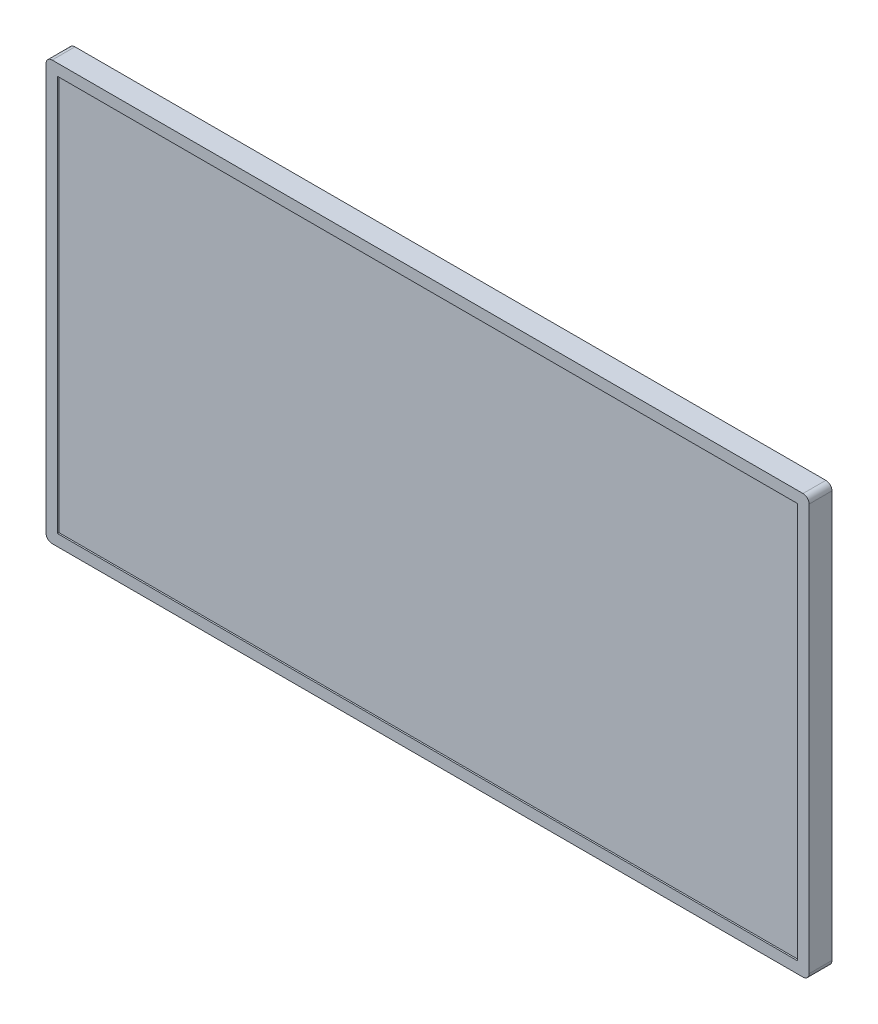
ISO-10303-21;
HEADER;
FILE_DESCRIPTION(('STEP AP214'),'2;1');
FILE_NAME('part.step','',(''),(''),'','','');
FILE_SCHEMA(('AUTOMOTIVE_DESIGN { 1 0 10303 214 1 1 1 1 }'));
ENDSEC;
DATA;
#1=APPLICATION_CONTEXT('core data for automotive mechanical design processes');
#2=APPLICATION_PROTOCOL_DEFINITION('international standard','automotive_design',2000,#1);
#3=PRODUCT_CONTEXT('',#1,'mechanical');
#4=PRODUCT('Part','Part','',(#3));
#5=PRODUCT_RELATED_PRODUCT_CATEGORY('part','',(#4));
#6=PRODUCT_DEFINITION_FORMATION('','',#4);
#7=PRODUCT_DEFINITION_CONTEXT('part definition',#1,'design');
#8=PRODUCT_DEFINITION('design','',#6,#7);
#9=PRODUCT_DEFINITION_SHAPE('','',#8);
#10=(LENGTH_UNIT() NAMED_UNIT(*) SI_UNIT(.MILLI.,.METRE.));
#11=(NAMED_UNIT(*) PLANE_ANGLE_UNIT() SI_UNIT($,.RADIAN.));
#12=(NAMED_UNIT(*) SI_UNIT($,.STERADIAN.) SOLID_ANGLE_UNIT());
#13=UNCERTAINTY_MEASURE_WITH_UNIT(LENGTH_MEASURE(1.E-05),#10,'distance_accuracy_value','');
#14=(GEOMETRIC_REPRESENTATION_CONTEXT(3) GLOBAL_UNCERTAINTY_ASSIGNED_CONTEXT((#13)) GLOBAL_UNIT_ASSIGNED_CONTEXT((#10,
#11,#12)) REPRESENTATION_CONTEXT('',''));
#15=CARTESIAN_POINT('',(0.,0.,0.));
#16=DIRECTION('',(0.,0.,1.));
#17=DIRECTION('',(1.,0.,0.));
#18=AXIS2_PLACEMENT_3D('',#15,#16,#17);
#19=CARTESIAN_POINT('',(0.,0.,30.));
#20=DIRECTION('',(1.,0.,0.));
#21=DIRECTION('',(0.,1.,0.));
#22=AXIS2_PLACEMENT_3D('',#19,#20,#21);
#23=PLANE('',#22);
#24=DIRECTION('',(0.,-1.,0.));
#25=VECTOR('',#24,1.);
#26=CARTESIAN_POINT('',(0.,0.,0.));
#27=LINE('',#26,#25);
#28=CARTESIAN_POINT('',(0.,542.,0.));
#29=VERTEX_POINT('',#28);
#30=CARTESIAN_POINT('',(0.,8.,0.));
#31=VERTEX_POINT('',#30);
#32=EDGE_CURVE('E163',#29,#31,#27,.T.);
#33=ORIENTED_EDGE('',*,*,#32,.T.);
#34=DIRECTION('',(0.,0.,-1.));
#35=VECTOR('',#34,1.);
#36=CARTESIAN_POINT('',(0.,8.,30.));
#37=LINE('',#36,#35);
#38=CARTESIAN_POINT('',(0.,8.,30.));
#39=VERTEX_POINT('',#38);
#40=EDGE_CURVE('E203',#31,#39,#37,.F.);
#41=ORIENTED_EDGE('',*,*,#40,.T.);
#42=DIRECTION('',(0.,-1.,0.));
#43=VECTOR('',#42,1.);
#44=CARTESIAN_POINT('',(0.,0.,30.));
#45=LINE('',#44,#43);
#46=CARTESIAN_POINT('',(0.,542.,30.));
#47=VERTEX_POINT('',#46);
#48=EDGE_CURVE('E167',#47,#39,#45,.T.);
#49=ORIENTED_EDGE('',*,*,#48,.F.);
#50=DIRECTION('',(0.,0.,-1.));
#51=VECTOR('',#50,1.);
#52=CARTESIAN_POINT('',(0.,542.,30.));
#53=LINE('',#52,#51);
#54=EDGE_CURVE('E200',#47,#29,#53,.T.);
#55=ORIENTED_EDGE('',*,*,#54,.T.);
#56=EDGE_LOOP('',(#33,#41,#49,#55));
#57=FACE_BOUND('',#56,.T.);
#58=ADVANCED_FACE('F34',(#57),#23,.F.);
#59=CARTESIAN_POINT('',(0.,0.,30.));
#60=DIRECTION('',(0.,1.,0.));
#61=DIRECTION('',(-1.,0.,0.));
#62=AXIS2_PLACEMENT_3D('',#59,#60,#61);
#63=PLANE('',#62);
#64=DIRECTION('',(1.,0.,0.));
#65=VECTOR('',#64,1.);
#66=CARTESIAN_POINT('',(0.,0.,30.));
#67=LINE('',#66,#65);
#68=CARTESIAN_POINT('',(8.,0.,30.));
#69=VERTEX_POINT('',#68);
#70=CARTESIAN_POINT('',(993.972554514344,0.,30.));
#71=VERTEX_POINT('',#70);
#72=EDGE_CURVE('E170',#69,#71,#67,.T.);
#73=ORIENTED_EDGE('',*,*,#72,.F.);
#74=DIRECTION('',(0.,0.,-1.));
#75=VECTOR('',#74,1.);
#76=CARTESIAN_POINT('',(8.,0.,30.));
#77=LINE('',#76,#75);
#78=CARTESIAN_POINT('',(8.,0.,0.));
#79=VERTEX_POINT('',#78);
#80=EDGE_CURVE('E189',#69,#79,#77,.T.);
#81=ORIENTED_EDGE('',*,*,#80,.T.);
#82=DIRECTION('',(1.,0.,0.));
#83=VECTOR('',#82,1.);
#84=CARTESIAN_POINT('',(0.,0.,0.));
#85=LINE('',#84,#83);
#86=CARTESIAN_POINT('',(993.972554514344,0.,0.));
#87=VERTEX_POINT('',#86);
#88=EDGE_CURVE('E181',#79,#87,#85,.T.);
#89=ORIENTED_EDGE('',*,*,#88,.T.);
#90=DIRECTION('',(0.,0.,-1.));
#91=VECTOR('',#90,1.);
#92=CARTESIAN_POINT('',(993.972554514344,0.,30.));
#93=LINE('',#92,#91);
#94=EDGE_CURVE('E178',#87,#71,#93,.F.);
#95=ORIENTED_EDGE('',*,*,#94,.T.);
#96=EDGE_LOOP('',(#73,#81,#89,#95));
#97=FACE_BOUND('',#96,.T.);
#98=ADVANCED_FACE('F246',(#97),#63,.F.);
#99=CARTESIAN_POINT('',(1001.97255451434,0.,30.));
#100=DIRECTION('',(-1.,0.,0.));
#101=DIRECTION('',(0.,0.,1.));
#102=AXIS2_PLACEMENT_3D('',#99,#100,#101);
#103=PLANE('',#102);
#104=DIRECTION('',(0.,1.,0.));
#105=VECTOR('',#104,1.);
#106=CARTESIAN_POINT('',(1001.97255451434,0.,30.));
#107=LINE('',#106,#105);
#108=CARTESIAN_POINT('',(1001.97255451434,8.,30.));
#109=VERTEX_POINT('',#108);
#110=CARTESIAN_POINT('',(1001.97255451434,542.,30.));
#111=VERTEX_POINT('',#110);
#112=EDGE_CURVE('E174',#109,#111,#107,.T.);
#113=ORIENTED_EDGE('',*,*,#112,.F.);
#114=DIRECTION('',(0.,0.,-1.));
#115=VECTOR('',#114,1.);
#116=CARTESIAN_POINT('',(1001.97255451434,8.,30.));
#117=LINE('',#116,#115);
#118=CARTESIAN_POINT('',(1001.97255451434,8.,0.));
#119=VERTEX_POINT('',#118);
#120=EDGE_CURVE('E214',#109,#119,#117,.T.);
#121=ORIENTED_EDGE('',*,*,#120,.T.);
#122=DIRECTION('',(0.,1.,0.));
#123=VECTOR('',#122,1.);
#124=CARTESIAN_POINT('',(1001.97255451434,0.,0.));
#125=LINE('',#124,#123);
#126=CARTESIAN_POINT('',(1001.97255451434,542.,0.));
#127=VERTEX_POINT('',#126);
#128=EDGE_CURVE('E184',#119,#127,#125,.T.);
#129=ORIENTED_EDGE('',*,*,#128,.T.);
#130=DIRECTION('',(0.,0.,-1.));
#131=VECTOR('',#130,1.);
#132=CARTESIAN_POINT('',(1001.97255451434,542.,30.));
#133=LINE('',#132,#131);
#134=EDGE_CURVE('E212',#127,#111,#133,.F.);
#135=ORIENTED_EDGE('',*,*,#134,.T.);
#136=EDGE_LOOP('',(#113,#121,#129,#135));
#137=FACE_BOUND('',#136,.T.);
#138=ADVANCED_FACE('F220',(#137),#103,.F.);
#139=CARTESIAN_POINT('',(0.,550.,30.));
#140=DIRECTION('',(0.,-1.,0.));
#141=DIRECTION('',(0.,0.,-1.));
#142=AXIS2_PLACEMENT_3D('',#139,#140,#141);
#143=PLANE('',#142);
#144=DIRECTION('',(-1.,0.,0.));
#145=VECTOR('',#144,1.);
#146=CARTESIAN_POINT('',(0.,550.,30.));
#147=LINE('',#146,#145);
#148=CARTESIAN_POINT('',(993.972554514344,550.,30.));
#149=VERTEX_POINT('',#148);
#150=CARTESIAN_POINT('',(8.00000000000004,550.,30.));
#151=VERTEX_POINT('',#150);
#152=EDGE_CURVE('E176',#149,#151,#147,.T.);
#153=ORIENTED_EDGE('',*,*,#152,.F.);
#154=DIRECTION('',(0.,0.,-1.));
#155=VECTOR('',#154,1.);
#156=CARTESIAN_POINT('',(993.972554514344,550.,30.));
#157=LINE('',#156,#155);
#158=CARTESIAN_POINT('',(993.972554514344,550.,0.));
#159=VERTEX_POINT('',#158);
#160=EDGE_CURVE('E11',#149,#159,#157,.T.);
#161=ORIENTED_EDGE('',*,*,#160,.T.);
#162=DIRECTION('',(-1.,0.,0.));
#163=VECTOR('',#162,1.);
#164=CARTESIAN_POINT('',(0.,550.,0.));
#165=LINE('',#164,#163);
#166=CARTESIAN_POINT('',(8.00000000000004,550.,0.));
#167=VERTEX_POINT('',#166);
#168=EDGE_CURVE('E171',#159,#167,#165,.T.);
#169=ORIENTED_EDGE('',*,*,#168,.T.);
#170=DIRECTION('',(0.,0.,-1.));
#171=VECTOR('',#170,1.);
#172=CARTESIAN_POINT('',(8.00000000000004,550.,30.));
#173=LINE('',#172,#171);
#174=EDGE_CURVE('E42',#167,#151,#173,.F.);
#175=ORIENTED_EDGE('',*,*,#174,.T.);
#176=EDGE_LOOP('',(#153,#161,#169,#175));
#177=FACE_BOUND('',#176,.T.);
#178=ADVANCED_FACE('F231',(#177),#143,.F.);
#179=CARTESIAN_POINT('',(0.,0.,30.));
#180=DIRECTION('',(0.,0.,-1.));
#181=DIRECTION('',(-1.,0.,0.));
#182=AXIS2_PLACEMENT_3D('',#179,#180,#181);
#183=PLANE('',#182);
#184=DIRECTION('',(1.,0.,0.));
#185=VECTOR('',#184,1.);
#186=CARTESIAN_POINT('',(986.972554514344,15.,30.));
#187=LINE('',#186,#185);
#188=CARTESIAN_POINT('',(15.0000000000001,15.,30.));
#189=VERTEX_POINT('',#188);
#190=CARTESIAN_POINT('',(986.972554514344,15.,30.));
#191=VERTEX_POINT('',#190);
#192=EDGE_CURVE('E157',#189,#191,#187,.T.);
#193=ORIENTED_EDGE('',*,*,#192,.F.);
#194=DIRECTION('',(0.,-1.,0.));
#195=VECTOR('',#194,1.);
#196=CARTESIAN_POINT('',(15.0000000000001,15.,30.));
#197=LINE('',#196,#195);
#198=CARTESIAN_POINT('',(15.0000000000001,535.,30.));
#199=VERTEX_POINT('',#198);
#200=EDGE_CURVE('E131',#199,#189,#197,.T.);
#201=ORIENTED_EDGE('',*,*,#200,.F.);
#202=DIRECTION('',(-1.,0.,0.));
#203=VECTOR('',#202,1.);
#204=CARTESIAN_POINT('',(986.972554514344,535.,30.));
#205=LINE('',#204,#203);
#206=CARTESIAN_POINT('',(986.972554514344,535.,30.));
#207=VERTEX_POINT('',#206);
#208=EDGE_CURVE('E148',#207,#199,#205,.T.);
#209=ORIENTED_EDGE('',*,*,#208,.F.);
#210=DIRECTION('',(0.,1.,0.));
#211=VECTOR('',#210,1.);
#212=CARTESIAN_POINT('',(986.972554514344,15.,30.));
#213=LINE('',#212,#211);
#214=EDGE_CURVE('E151',#191,#207,#213,.T.);
#215=ORIENTED_EDGE('',*,*,#214,.F.);
#216=EDGE_LOOP('',(#193,#201,#209,#215));
#217=FACE_BOUND('',#216,.T.);
#218=ORIENTED_EDGE('',*,*,#48,.T.);
#219=CARTESIAN_POINT('',(8.,8.,30.));
#220=DIRECTION('',(0.,0.,-1.));
#221=DIRECTION('',(-1.,0.,0.));
#222=AXIS2_PLACEMENT_3D('',#219,#220,#221);
#223=CIRCLE('',#222,8.);
#224=EDGE_CURVE('E210',#39,#69,#223,.F.);
#225=ORIENTED_EDGE('',*,*,#224,.T.);
#226=ORIENTED_EDGE('',*,*,#72,.T.);
#227=CARTESIAN_POINT('',(993.972554514344,8.,30.));
#228=DIRECTION('',(0.,0.,-1.));
#229=DIRECTION('',(-1.,0.,0.));
#230=AXIS2_PLACEMENT_3D('',#227,#228,#229);
#231=CIRCLE('',#230,8.);
#232=EDGE_CURVE('E208',#71,#109,#231,.F.);
#233=ORIENTED_EDGE('',*,*,#232,.T.);
#234=ORIENTED_EDGE('',*,*,#112,.T.);
#235=CARTESIAN_POINT('',(993.972554514344,542.,30.));
#236=DIRECTION('',(0.,0.,-1.));
#237=DIRECTION('',(-1.,0.,0.));
#238=AXIS2_PLACEMENT_3D('',#235,#236,#237);
#239=CIRCLE('',#238,8.);
#240=EDGE_CURVE('E55',#111,#149,#239,.F.);
#241=ORIENTED_EDGE('',*,*,#240,.T.);
#242=ORIENTED_EDGE('',*,*,#152,.T.);
#243=CARTESIAN_POINT('',(8.00000000000004,542.,30.));
#244=DIRECTION('',(0.,0.,-1.));
#245=DIRECTION('',(-1.,0.,0.));
#246=AXIS2_PLACEMENT_3D('',#243,#244,#245);
#247=CIRCLE('',#246,8.);
#248=EDGE_CURVE('E205',#151,#47,#247,.F.);
#249=ORIENTED_EDGE('',*,*,#248,.T.);
#250=EDGE_LOOP('',(#218,#225,#226,#233,#234,#241,#242,#249));
#251=FACE_BOUND('',#250,.T.);
#252=ADVANCED_FACE('F233',(#217,#251),#183,.F.);
#253=CARTESIAN_POINT('',(0.,0.,0.));
#254=DIRECTION('',(0.,0.,-1.));
#255=DIRECTION('',(-1.,0.,0.));
#256=AXIS2_PLACEMENT_3D('',#253,#254,#255);
#257=PLANE('',#256);
#258=ORIENTED_EDGE('',*,*,#88,.F.);
#259=CARTESIAN_POINT('',(8.,8.,0.));
#260=DIRECTION('',(0.,0.,-1.));
#261=DIRECTION('',(-1.,0.,0.));
#262=AXIS2_PLACEMENT_3D('',#259,#260,#261);
#263=CIRCLE('',#262,8.);
#264=EDGE_CURVE('E198',#79,#31,#263,.T.);
#265=ORIENTED_EDGE('',*,*,#264,.T.);
#266=ORIENTED_EDGE('',*,*,#32,.F.);
#267=CARTESIAN_POINT('',(8.00000000000004,542.,0.));
#268=DIRECTION('',(0.,0.,-1.));
#269=DIRECTION('',(-1.,0.,0.));
#270=AXIS2_PLACEMENT_3D('',#267,#268,#269);
#271=CIRCLE('',#270,8.);
#272=EDGE_CURVE('E192',#29,#167,#271,.T.);
#273=ORIENTED_EDGE('',*,*,#272,.T.);
#274=ORIENTED_EDGE('',*,*,#168,.F.);
#275=CARTESIAN_POINT('',(993.972554514344,542.,0.));
#276=DIRECTION('',(0.,0.,-1.));
#277=DIRECTION('',(-1.,0.,0.));
#278=AXIS2_PLACEMENT_3D('',#275,#276,#277);
#279=CIRCLE('',#278,8.);
#280=EDGE_CURVE('E194',#159,#127,#279,.T.);
#281=ORIENTED_EDGE('',*,*,#280,.T.);
#282=ORIENTED_EDGE('',*,*,#128,.F.);
#283=CARTESIAN_POINT('',(993.972554514344,8.,0.));
#284=DIRECTION('',(0.,0.,-1.));
#285=DIRECTION('',(-1.,0.,0.));
#286=AXIS2_PLACEMENT_3D('',#283,#284,#285);
#287=CIRCLE('',#286,8.);
#288=EDGE_CURVE('E196',#119,#87,#287,.T.);
#289=ORIENTED_EDGE('',*,*,#288,.T.);
#290=EDGE_LOOP('',(#258,#265,#266,#273,#274,#281,#282,#289));
#291=FACE_BOUND('',#290,.T.);
#292=ADVANCED_FACE('F226',(#291),#257,.T.);
#293=CARTESIAN_POINT('',(15.0000000000001,15.,28.));
#294=DIRECTION('',(-1.,0.,0.));
#295=DIRECTION('',(0.,0.,1.));
#296=AXIS2_PLACEMENT_3D('',#293,#294,#295);
#297=PLANE('',#296);
#298=ORIENTED_EDGE('',*,*,#200,.T.);
#299=DIRECTION('',(0.,0.,1.));
#300=VECTOR('',#299,1.);
#301=CARTESIAN_POINT('',(15.0000000000001,15.,28.));
#302=LINE('',#301,#300);
#303=CARTESIAN_POINT('',(15.0000000000001,15.,28.));
#304=VERTEX_POINT('',#303);
#305=EDGE_CURVE('E124',#304,#189,#302,.T.);
#306=ORIENTED_EDGE('',*,*,#305,.F.);
#307=DIRECTION('',(0.,-1.,0.));
#308=VECTOR('',#307,1.);
#309=CARTESIAN_POINT('',(15.0000000000001,15.,28.));
#310=LINE('',#309,#308);
#311=CARTESIAN_POINT('',(15.0000000000001,535.,28.));
#312=VERTEX_POINT('',#311);
#313=EDGE_CURVE('E128',#312,#304,#310,.T.);
#314=ORIENTED_EDGE('',*,*,#313,.F.);
#315=DIRECTION('',(0.,0.,1.));
#316=VECTOR('',#315,1.);
#317=CARTESIAN_POINT('',(15.0000000000001,535.,28.));
#318=LINE('',#317,#316);
#319=EDGE_CURVE('E161',#312,#199,#318,.T.);
#320=ORIENTED_EDGE('',*,*,#319,.T.);
#321=EDGE_LOOP('',(#298,#306,#314,#320));
#322=FACE_BOUND('',#321,.T.);
#323=ADVANCED_FACE('F126',(#322),#297,.F.);
#324=CARTESIAN_POINT('',(986.972554514344,535.,28.));
#325=DIRECTION('',(0.,1.,0.));
#326=DIRECTION('',(0.,0.,1.));
#327=AXIS2_PLACEMENT_3D('',#324,#325,#326);
#328=PLANE('',#327);
#329=ORIENTED_EDGE('',*,*,#208,.T.);
#330=ORIENTED_EDGE('',*,*,#319,.F.);
#331=DIRECTION('',(-1.,0.,0.));
#332=VECTOR('',#331,1.);
#333=CARTESIAN_POINT('',(986.972554514344,535.,28.));
#334=LINE('',#333,#332);
#335=CARTESIAN_POINT('',(986.972554514344,535.,28.));
#336=VERTEX_POINT('',#335);
#337=EDGE_CURVE('E136',#336,#312,#334,.T.);
#338=ORIENTED_EDGE('',*,*,#337,.F.);
#339=DIRECTION('',(0.,0.,1.));
#340=VECTOR('',#339,1.);
#341=CARTESIAN_POINT('',(986.972554514344,535.,28.));
#342=LINE('',#341,#340);
#343=EDGE_CURVE('E164',#336,#207,#342,.T.);
#344=ORIENTED_EDGE('',*,*,#343,.T.);
#345=EDGE_LOOP('',(#329,#330,#338,#344));
#346=FACE_BOUND('',#345,.T.);
#347=ADVANCED_FACE('F274',(#346),#328,.F.);
#348=CARTESIAN_POINT('',(986.972554514344,15.,28.));
#349=DIRECTION('',(1.,0.,0.));
#350=DIRECTION('',(0.,0.,-1.));
#351=AXIS2_PLACEMENT_3D('',#348,#349,#350);
#352=PLANE('',#351);
#353=ORIENTED_EDGE('',*,*,#214,.T.);
#354=ORIENTED_EDGE('',*,*,#343,.F.);
#355=DIRECTION('',(0.,1.,0.));
#356=VECTOR('',#355,1.);
#357=CARTESIAN_POINT('',(986.972554514344,15.,28.));
#358=LINE('',#357,#356);
#359=CARTESIAN_POINT('',(986.972554514344,15.,28.));
#360=VERTEX_POINT('',#359);
#361=EDGE_CURVE('E144',#360,#336,#358,.T.);
#362=ORIENTED_EDGE('',*,*,#361,.F.);
#363=DIRECTION('',(0.,0.,1.));
#364=VECTOR('',#363,1.);
#365=CARTESIAN_POINT('',(986.972554514344,15.,28.));
#366=LINE('',#365,#364);
#367=EDGE_CURVE('E135',#360,#191,#366,.T.);
#368=ORIENTED_EDGE('',*,*,#367,.T.);
#369=EDGE_LOOP('',(#353,#354,#362,#368));
#370=FACE_BOUND('',#369,.T.);
#371=ADVANCED_FACE('F277',(#370),#352,.F.);
#372=CARTESIAN_POINT('',(986.972554514344,15.,28.));
#373=DIRECTION('',(0.,-1.,0.));
#374=DIRECTION('',(0.,0.,-1.));
#375=AXIS2_PLACEMENT_3D('',#372,#373,#374);
#376=PLANE('',#375);
#377=ORIENTED_EDGE('',*,*,#192,.T.);
#378=ORIENTED_EDGE('',*,*,#367,.F.);
#379=DIRECTION('',(1.,0.,0.));
#380=VECTOR('',#379,1.);
#381=CARTESIAN_POINT('',(986.972554514344,15.,28.));
#382=LINE('',#381,#380);
#383=EDGE_CURVE('E139',#304,#360,#382,.T.);
#384=ORIENTED_EDGE('',*,*,#383,.F.);
#385=ORIENTED_EDGE('',*,*,#305,.T.);
#386=EDGE_LOOP('',(#377,#378,#384,#385));
#387=FACE_BOUND('',#386,.T.);
#388=ADVANCED_FACE('F140',(#387),#376,.F.);
#389=CARTESIAN_POINT('',(0.,0.,28.));
#390=DIRECTION('',(0.,0.,1.));
#391=DIRECTION('',(1.,0.,0.));
#392=AXIS2_PLACEMENT_3D('',#389,#390,#391);
#393=PLANE('',#392);
#394=ORIENTED_EDGE('',*,*,#313,.T.);
#395=ORIENTED_EDGE('',*,*,#383,.T.);
#396=ORIENTED_EDGE('',*,*,#361,.T.);
#397=ORIENTED_EDGE('',*,*,#337,.T.);
#398=EDGE_LOOP('',(#394,#395,#396,#397));
#399=FACE_BOUND('',#398,.T.);
#400=ADVANCED_FACE('F146',(#399),#393,.T.);
#401=CARTESIAN_POINT('',(8.,8.,30.));
#402=DIRECTION('',(0.,0.,-1.));
#403=DIRECTION('',(-1.,0.,0.));
#404=AXIS2_PLACEMENT_3D('',#401,#402,#403);
#405=CYLINDRICAL_SURFACE('',#404,8.);
#406=ORIENTED_EDGE('',*,*,#224,.F.);
#407=ORIENTED_EDGE('',*,*,#40,.F.);
#408=ORIENTED_EDGE('',*,*,#264,.F.);
#409=ORIENTED_EDGE('',*,*,#80,.F.);
#410=EDGE_LOOP('',(#406,#407,#408,#409));
#411=FACE_BOUND('',#410,.T.);
#412=ADVANCED_FACE('F243',(#411),#405,.T.);
#413=CARTESIAN_POINT('',(993.972554514344,8.,30.));
#414=DIRECTION('',(0.,0.,-1.));
#415=DIRECTION('',(-1.,0.,0.));
#416=AXIS2_PLACEMENT_3D('',#413,#414,#415);
#417=CYLINDRICAL_SURFACE('',#416,8.);
#418=ORIENTED_EDGE('',*,*,#232,.F.);
#419=ORIENTED_EDGE('',*,*,#94,.F.);
#420=ORIENTED_EDGE('',*,*,#288,.F.);
#421=ORIENTED_EDGE('',*,*,#120,.F.);
#422=EDGE_LOOP('',(#418,#419,#420,#421));
#423=FACE_BOUND('',#422,.T.);
#424=ADVANCED_FACE('F248',(#423),#417,.T.);
#425=CARTESIAN_POINT('',(993.972554514344,542.,30.));
#426=DIRECTION('',(0.,0.,-1.));
#427=DIRECTION('',(-1.,0.,0.));
#428=AXIS2_PLACEMENT_3D('',#425,#426,#427);
#429=CYLINDRICAL_SURFACE('',#428,8.);
#430=ORIENTED_EDGE('',*,*,#240,.F.);
#431=ORIENTED_EDGE('',*,*,#134,.F.);
#432=ORIENTED_EDGE('',*,*,#280,.F.);
#433=ORIENTED_EDGE('',*,*,#160,.F.);
#434=EDGE_LOOP('',(#430,#431,#432,#433));
#435=FACE_BOUND('',#434,.T.);
#436=ADVANCED_FACE('F230',(#435),#429,.T.);
#437=CARTESIAN_POINT('',(8.00000000000004,542.,30.));
#438=DIRECTION('',(0.,0.,-1.));
#439=DIRECTION('',(-1.,0.,0.));
#440=AXIS2_PLACEMENT_3D('',#437,#438,#439);
#441=CYLINDRICAL_SURFACE('',#440,8.);
#442=ORIENTED_EDGE('',*,*,#248,.F.);
#443=ORIENTED_EDGE('',*,*,#174,.F.);
#444=ORIENTED_EDGE('',*,*,#272,.F.);
#445=ORIENTED_EDGE('',*,*,#54,.F.);
#446=EDGE_LOOP('',(#442,#443,#444,#445));
#447=FACE_BOUND('',#446,.T.);
#448=ADVANCED_FACE('F36',(#447),#441,.T.);
#449=CLOSED_SHELL('',(#58,#98,#138,#178,#252,#292,#323,#347,#371,#388,#400,#412,#424,#436,#448));
#450=MANIFOLD_SOLID_BREP('B2',#449);
#451=ADVANCED_BREP_SHAPE_REPRESENTATION('',(#18,#450),#14);
#452=SHAPE_DEFINITION_REPRESENTATION(#9,#451);
ENDSEC;
END-ISO-10303-21;
